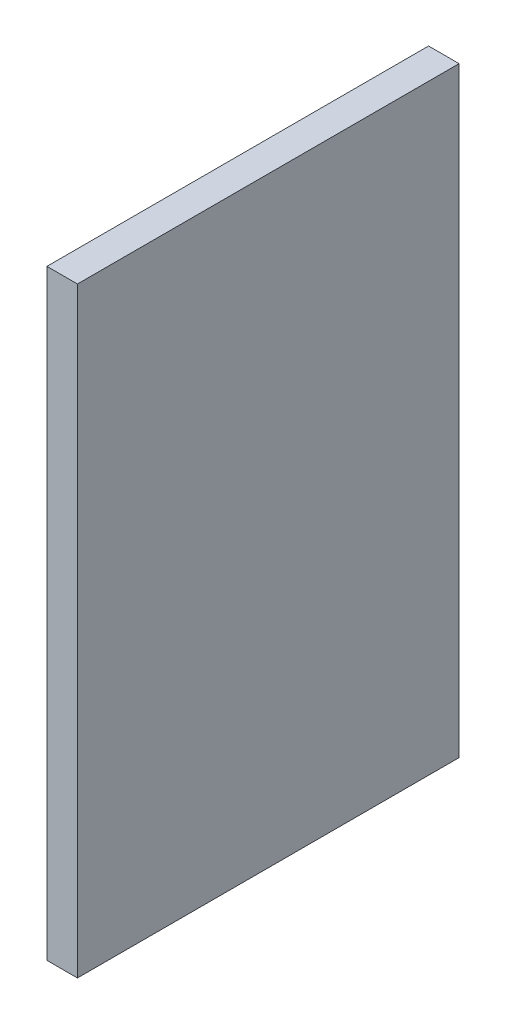
ISO-10303-21;
HEADER;
FILE_DESCRIPTION(('STEP AP214'),'2;1');
FILE_NAME('part.step','',(''),(''),'','','');
FILE_SCHEMA(('AUTOMOTIVE_DESIGN { 1 0 10303 214 1 1 1 1 }'));
ENDSEC;
DATA;
#1=APPLICATION_CONTEXT('core data for automotive mechanical design processes');
#2=APPLICATION_PROTOCOL_DEFINITION('international standard','automotive_design',2000,#1);
#3=PRODUCT_CONTEXT('',#1,'mechanical');
#4=PRODUCT('Part','Part','',(#3));
#5=PRODUCT_RELATED_PRODUCT_CATEGORY('part','',(#4));
#6=PRODUCT_DEFINITION_FORMATION('','',#4);
#7=PRODUCT_DEFINITION_CONTEXT('part definition',#1,'design');
#8=PRODUCT_DEFINITION('design','',#6,#7);
#9=PRODUCT_DEFINITION_SHAPE('','',#8);
#10=(LENGTH_UNIT() NAMED_UNIT(*) SI_UNIT(.MILLI.,.METRE.));
#11=(NAMED_UNIT(*) PLANE_ANGLE_UNIT() SI_UNIT($,.RADIAN.));
#12=(NAMED_UNIT(*) SI_UNIT($,.STERADIAN.) SOLID_ANGLE_UNIT());
#13=UNCERTAINTY_MEASURE_WITH_UNIT(LENGTH_MEASURE(1.E-05),#10,'distance_accuracy_value','');
#14=(GEOMETRIC_REPRESENTATION_CONTEXT(3) GLOBAL_UNCERTAINTY_ASSIGNED_CONTEXT((#13)) GLOBAL_UNIT_ASSIGNED_CONTEXT((#10,
#11,#12)) REPRESENTATION_CONTEXT('',''));
#15=CARTESIAN_POINT('',(0.,0.,0.));
#16=DIRECTION('',(0.,0.,1.));
#17=DIRECTION('',(1.,0.,0.));
#18=AXIS2_PLACEMENT_3D('',#15,#16,#17);
#19=CARTESIAN_POINT('',(0.,49.9999,0.));
#20=DIRECTION('',(1.,0.,0.));
#21=DIRECTION('',(0.,0.,-1.));
#22=AXIS2_PLACEMENT_3D('',#19,#20,#21);
#23=PLANE('',#22);
#24=CARTESIAN_POINT('',(0.,35.0012,-15.8750000000001));
#25=DIRECTION('',(1.,0.,0.));
#26=DIRECTION('',(0.,0.,1.));
#27=AXIS2_PLACEMENT_3D('',#24,#25,#26);
#28=CIRCLE('',#27,2.99974);
#29=CARTESIAN_POINT('',(0.,35.0012,-12.8752600000001));
#30=VERTEX_POINT('',#29);
#31=EDGE_CURVE('E291',#30,#30,#28,.T.);
#32=ORIENTED_EDGE('',*,*,#31,.T.);
#33=EDGE_LOOP('',(#32));
#34=FACE_BOUND('',#33,.T.);
#35=CARTESIAN_POINT('',(0.,15.00124,-15.875));
#36=DIRECTION('',(1.,0.,0.));
#37=DIRECTION('',(0.,0.,-1.));
#38=AXIS2_PLACEMENT_3D('',#35,#36,#37);
#39=CIRCLE('',#38,2.99974);
#40=CARTESIAN_POINT('',(0.,15.00124,-18.87474));
#41=VERTEX_POINT('',#40);
#42=EDGE_CURVE('E281',#41,#41,#39,.T.);
#43=ORIENTED_EDGE('',*,*,#42,.T.);
#44=EDGE_LOOP('',(#43));
#45=FACE_BOUND('',#44,.T.);
#46=DIRECTION('',(0.,0.,1.));
#47=VECTOR('',#46,1.);
#48=CARTESIAN_POINT('',(0.,0.,0.));
#49=LINE('',#48,#47);
#50=CARTESIAN_POINT('',(0.,0.,-31.75));
#51=VERTEX_POINT('',#50);
#52=CARTESIAN_POINT('',(0.,0.,0.));
#53=VERTEX_POINT('',#52);
#54=EDGE_CURVE('E122',#51,#53,#49,.T.);
#55=ORIENTED_EDGE('',*,*,#54,.T.);
#56=DIRECTION('',(0.,-1.,0.));
#57=VECTOR('',#56,1.);
#58=CARTESIAN_POINT('',(0.,49.9999,0.));
#59=LINE('',#58,#57);
#60=CARTESIAN_POINT('',(0.,49.9999,0.));
#61=VERTEX_POINT('',#60);
#62=EDGE_CURVE('E109',#61,#53,#59,.T.);
#63=ORIENTED_EDGE('',*,*,#62,.F.);
#64=DIRECTION('',(0.,0.,1.));
#65=VECTOR('',#64,1.);
#66=CARTESIAN_POINT('',(0.,49.9999,0.));
#67=LINE('',#66,#65);
#68=CARTESIAN_POINT('',(0.,49.9999,-31.75));
#69=VERTEX_POINT('',#68);
#70=EDGE_CURVE('E101',#69,#61,#67,.T.);
#71=ORIENTED_EDGE('',*,*,#70,.F.);
#72=DIRECTION('',(0.,-1.,0.));
#73=VECTOR('',#72,1.);
#74=CARTESIAN_POINT('',(0.,49.9999,-31.75));
#75=LINE('',#74,#73);
#76=EDGE_CURVE('E118',#69,#51,#75,.T.);
#77=ORIENTED_EDGE('',*,*,#76,.T.);
#78=EDGE_LOOP('',(#55,#63,#71,#77));
#79=FACE_BOUND('',#78,.T.);
#80=ADVANCED_FACE('F40',(#34,#45,#79),#23,.F.);
#81=CARTESIAN_POINT('',(0.,49.9999,0.));
#82=DIRECTION('',(0.,0.,-1.));
#83=DIRECTION('',(-1.,0.,0.));
#84=AXIS2_PLACEMENT_3D('',#81,#82,#83);
#85=PLANE('',#84);
#86=DIRECTION('',(1.,0.,0.));
#87=VECTOR('',#86,1.);
#88=CARTESIAN_POINT('',(0.,0.,0.));
#89=LINE('',#88,#87);
#90=CARTESIAN_POINT('',(2.54,0.,0.));
#91=VERTEX_POINT('',#90);
#92=EDGE_CURVE('E107',#53,#91,#89,.T.);
#93=ORIENTED_EDGE('',*,*,#92,.T.);
#94=DIRECTION('',(0.,-1.,0.));
#95=VECTOR('',#94,1.);
#96=CARTESIAN_POINT('',(2.54,49.9999,0.));
#97=LINE('',#96,#95);
#98=CARTESIAN_POINT('',(2.54,49.9999,0.));
#99=VERTEX_POINT('',#98);
#100=EDGE_CURVE('E105',#99,#91,#97,.T.);
#101=ORIENTED_EDGE('',*,*,#100,.F.);
#102=DIRECTION('',(1.,0.,0.));
#103=VECTOR('',#102,1.);
#104=CARTESIAN_POINT('',(0.,49.9999,0.));
#105=LINE('',#104,#103);
#106=EDGE_CURVE('E96',#61,#99,#105,.T.);
#107=ORIENTED_EDGE('',*,*,#106,.F.);
#108=ORIENTED_EDGE('',*,*,#62,.T.);
#109=EDGE_LOOP('',(#93,#101,#107,#108));
#110=FACE_BOUND('',#109,.T.);
#111=ADVANCED_FACE('F106',(#110),#85,.F.);
#112=CARTESIAN_POINT('',(2.54,49.9999,0.));
#113=DIRECTION('',(-1.,0.,0.));
#114=DIRECTION('',(0.,0.,1.));
#115=AXIS2_PLACEMENT_3D('',#112,#113,#114);
#116=PLANE('',#115);
#117=DIRECTION('',(0.,0.,-1.));
#118=VECTOR('',#117,1.);
#119=CARTESIAN_POINT('',(2.54,0.,0.));
#120=LINE('',#119,#118);
#121=CARTESIAN_POINT('',(2.54,0.,-31.75));
#122=VERTEX_POINT('',#121);
#123=EDGE_CURVE('E80',#91,#122,#120,.T.);
#124=ORIENTED_EDGE('',*,*,#123,.T.);
#125=DIRECTION('',(0.,-1.,0.));
#126=VECTOR('',#125,1.);
#127=CARTESIAN_POINT('',(2.54,49.9999,-31.75));
#128=LINE('',#127,#126);
#129=CARTESIAN_POINT('',(2.54,49.9999,-31.75));
#130=VERTEX_POINT('',#129);
#131=EDGE_CURVE('E110',#130,#122,#128,.T.);
#132=ORIENTED_EDGE('',*,*,#131,.F.);
#133=DIRECTION('',(0.,0.,-1.));
#134=VECTOR('',#133,1.);
#135=CARTESIAN_POINT('',(2.54,49.9999,0.));
#136=LINE('',#135,#134);
#137=EDGE_CURVE('E99',#99,#130,#136,.T.);
#138=ORIENTED_EDGE('',*,*,#137,.F.);
#139=ORIENTED_EDGE('',*,*,#100,.T.);
#140=EDGE_LOOP('',(#124,#132,#138,#139));
#141=FACE_BOUND('',#140,.T.);
#142=ADVANCED_FACE('F112',(#141),#116,.F.);
#143=CARTESIAN_POINT('',(0.,49.9999,-31.75));
#144=DIRECTION('',(0.,0.,1.));
#145=DIRECTION('',(1.,0.,0.));
#146=AXIS2_PLACEMENT_3D('',#143,#144,#145);
#147=PLANE('',#146);
#148=DIRECTION('',(-1.,0.,0.));
#149=VECTOR('',#148,1.);
#150=CARTESIAN_POINT('',(0.,0.,-31.75));
#151=LINE('',#150,#149);
#152=EDGE_CURVE('E86',#122,#51,#151,.T.);
#153=ORIENTED_EDGE('',*,*,#152,.T.);
#154=ORIENTED_EDGE('',*,*,#76,.F.);
#155=DIRECTION('',(-1.,0.,0.));
#156=VECTOR('',#155,1.);
#157=CARTESIAN_POINT('',(0.,49.9999,-31.75));
#158=LINE('',#157,#156);
#159=EDGE_CURVE('E60',#130,#69,#158,.T.);
#160=ORIENTED_EDGE('',*,*,#159,.F.);
#161=ORIENTED_EDGE('',*,*,#131,.T.);
#162=EDGE_LOOP('',(#153,#154,#160,#161));
#163=FACE_BOUND('',#162,.T.);
#164=ADVANCED_FACE('F188',(#163),#147,.F.);
#165=CARTESIAN_POINT('',(0.,49.9999,0.));
#166=DIRECTION('',(0.,-1.,0.));
#167=DIRECTION('',(0.,0.,-1.));
#168=AXIS2_PLACEMENT_3D('',#165,#166,#167);
#169=PLANE('',#168);
#170=ORIENTED_EDGE('',*,*,#70,.T.);
#171=ORIENTED_EDGE('',*,*,#106,.T.);
#172=ORIENTED_EDGE('',*,*,#137,.T.);
#173=ORIENTED_EDGE('',*,*,#159,.T.);
#174=EDGE_LOOP('',(#170,#171,#172,#173));
#175=FACE_BOUND('',#174,.T.);
#176=ADVANCED_FACE('F97',(#175),#169,.F.);
#177=CARTESIAN_POINT('',(0.,0.,0.));
#178=DIRECTION('',(0.,-1.,0.));
#179=DIRECTION('',(0.,0.,-1.));
#180=AXIS2_PLACEMENT_3D('',#177,#178,#179);
#181=PLANE('',#180);
#182=ORIENTED_EDGE('',*,*,#54,.F.);
#183=ORIENTED_EDGE('',*,*,#152,.F.);
#184=ORIENTED_EDGE('',*,*,#123,.F.);
#185=ORIENTED_EDGE('',*,*,#92,.F.);
#186=EDGE_LOOP('',(#182,#183,#184,#185));
#187=FACE_BOUND('',#186,.T.);
#188=ADVANCED_FACE('F184',(#187),#181,.T.);
#189=CARTESIAN_POINT('',(-8.6106,15.00124,-15.875));
#190=DIRECTION('',(1.,0.,0.));
#191=DIRECTION('',(0.,0.,-1.));
#192=AXIS2_PLACEMENT_3D('',#189,#190,#191);
#193=CYLINDRICAL_SURFACE('',#192,2.99974);
#194=CARTESIAN_POINT('',(-8.6106,15.00124,-15.875));
#195=DIRECTION('',(1.,0.,0.));
#196=DIRECTION('',(0.,0.,-1.));
#197=AXIS2_PLACEMENT_3D('',#194,#195,#196);
#198=CIRCLE('',#197,2.99974);
#199=CARTESIAN_POINT('',(-8.6106,15.00124,-18.87474));
#200=VERTEX_POINT('',#199);
#201=EDGE_CURVE('E126',#200,#200,#198,.T.);
#202=ORIENTED_EDGE('',*,*,#201,.T.);
#203=EDGE_LOOP('',(#202));
#204=FACE_BOUND('',#203,.T.);
#205=ORIENTED_EDGE('',*,*,#42,.F.);
#206=EDGE_LOOP('',(#205));
#207=FACE_BOUND('',#206,.T.);
#208=ADVANCED_FACE('F180',(#204,#207),#193,.T.);
#209=CARTESIAN_POINT('',(-8.6106,15.00124,-15.875));
#210=DIRECTION('',(1.,0.,0.));
#211=DIRECTION('',(0.,0.,-1.));
#212=AXIS2_PLACEMENT_3D('',#209,#210,#211);
#213=PLANE('',#212);
#214=CARTESIAN_POINT('',(-8.6106,15.00124,-15.875));
#215=DIRECTION('',(1.,0.,0.));
#216=DIRECTION('',(0.,0.,-1.));
#217=AXIS2_PLACEMENT_3D('',#214,#215,#216);
#218=CIRCLE('',#217,1.6002);
#219=CARTESIAN_POINT('',(-8.6106,15.00124,-17.4752));
#220=VERTEX_POINT('',#219);
#221=EDGE_CURVE('E284',#220,#220,#218,.T.);
#222=ORIENTED_EDGE('',*,*,#221,.T.);
#223=EDGE_LOOP('',(#222));
#224=FACE_BOUND('',#223,.T.);
#225=ORIENTED_EDGE('',*,*,#201,.F.);
#226=EDGE_LOOP('',(#225));
#227=FACE_BOUND('',#226,.T.);
#228=ADVANCED_FACE('F156',(#224,#227),#213,.F.);
#229=CARTESIAN_POINT('',(-8.6106,15.00124,-15.875));
#230=DIRECTION('',(1.,0.,0.));
#231=DIRECTION('',(0.,0.,-1.));
#232=AXIS2_PLACEMENT_3D('',#229,#230,#231);
#233=CYLINDRICAL_SURFACE('',#232,1.6002);
#234=ORIENTED_EDGE('',*,*,#221,.F.);
#235=EDGE_LOOP('',(#234));
#236=FACE_BOUND('',#235,.T.);
#237=CARTESIAN_POINT('',(0.,15.00124,-15.875));
#238=DIRECTION('',(1.,0.,0.));
#239=DIRECTION('',(0.,0.,-1.));
#240=AXIS2_PLACEMENT_3D('',#237,#238,#239);
#241=CIRCLE('',#240,1.6002);
#242=CARTESIAN_POINT('',(0.,15.00124,-17.4752));
#243=VERTEX_POINT('',#242);
#244=EDGE_CURVE('E49',#243,#243,#241,.T.);
#245=ORIENTED_EDGE('',*,*,#244,.T.);
#246=EDGE_LOOP('',(#245));
#247=FACE_BOUND('',#246,.T.);
#248=ADVANCED_FACE('F143',(#236,#247),#233,.F.);
#249=ORIENTED_EDGE('',*,*,#244,.F.);
#250=EDGE_LOOP('',(#249));
#251=FACE_BOUND('',#250,.T.);
#252=ADVANCED_FACE('F145',(#251),#23,.F.);
#253=CARTESIAN_POINT('',(-8.6106,35.0012,-15.8750000000001));
#254=DIRECTION('',(1.,0.,0.));
#255=DIRECTION('',(0.,0.,-1.));
#256=AXIS2_PLACEMENT_3D('',#253,#254,#255);
#257=CYLINDRICAL_SURFACE('',#256,2.99974);
#258=CARTESIAN_POINT('',(-8.6106,35.0012,-15.8750000000001));
#259=DIRECTION('',(1.,0.,0.));
#260=DIRECTION('',(0.,0.,1.));
#261=AXIS2_PLACEMENT_3D('',#258,#259,#260);
#262=CIRCLE('',#261,2.99974);
#263=CARTESIAN_POINT('',(-8.6106,35.0012,-12.8752600000001));
#264=VERTEX_POINT('',#263);
#265=EDGE_CURVE('E290',#264,#264,#262,.T.);
#266=ORIENTED_EDGE('',*,*,#265,.T.);
#267=EDGE_LOOP('',(#266));
#268=FACE_BOUND('',#267,.T.);
#269=ORIENTED_EDGE('',*,*,#31,.F.);
#270=EDGE_LOOP('',(#269));
#271=FACE_BOUND('',#270,.T.);
#272=ADVANCED_FACE('F147',(#268,#271),#257,.T.);
#273=CARTESIAN_POINT('',(-8.6106,35.0012,-15.8750000000001));
#274=DIRECTION('',(-1.,0.,0.));
#275=DIRECTION('',(0.,0.,1.));
#276=AXIS2_PLACEMENT_3D('',#273,#274,#275);
#277=PLANE('',#276);
#278=CARTESIAN_POINT('',(-8.6106,35.0012,-15.8750000000001));
#279=DIRECTION('',(1.,0.,0.));
#280=DIRECTION('',(0.,0.,1.));
#281=AXIS2_PLACEMENT_3D('',#278,#279,#280);
#282=CIRCLE('',#281,1.6002);
#283=CARTESIAN_POINT('',(-8.6106,35.0012,-14.2748000000001));
#284=VERTEX_POINT('',#283);
#285=EDGE_CURVE('E295',#284,#284,#282,.T.);
#286=ORIENTED_EDGE('',*,*,#285,.T.);
#287=EDGE_LOOP('',(#286));
#288=FACE_BOUND('',#287,.T.);
#289=ORIENTED_EDGE('',*,*,#265,.F.);
#290=EDGE_LOOP('',(#289));
#291=FACE_BOUND('',#290,.T.);
#292=ADVANCED_FACE('F153',(#288,#291),#277,.T.);
#293=CARTESIAN_POINT('',(-8.6106,35.0012,-15.8750000000001));
#294=DIRECTION('',(1.,0.,0.));
#295=DIRECTION('',(0.,0.,-1.));
#296=AXIS2_PLACEMENT_3D('',#293,#294,#295);
#297=CYLINDRICAL_SURFACE('',#296,1.6002);
#298=ORIENTED_EDGE('',*,*,#285,.F.);
#299=EDGE_LOOP('',(#298));
#300=FACE_BOUND('',#299,.T.);
#301=CARTESIAN_POINT('',(0.,35.0012,-15.8750000000001));
#302=DIRECTION('',(1.,0.,0.));
#303=DIRECTION('',(0.,0.,-1.));
#304=AXIS2_PLACEMENT_3D('',#301,#302,#303);
#305=CIRCLE('',#304,1.6002);
#306=CARTESIAN_POINT('',(0.,35.0012,-17.4752000000001));
#307=VERTEX_POINT('',#306);
#308=EDGE_CURVE('E11',#307,#307,#305,.T.);
#309=ORIENTED_EDGE('',*,*,#308,.T.);
#310=EDGE_LOOP('',(#309));
#311=FACE_BOUND('',#310,.T.);
#312=ADVANCED_FACE('F162',(#300,#311),#297,.F.);
#313=ORIENTED_EDGE('',*,*,#308,.F.);
#314=EDGE_LOOP('',(#313));
#315=FACE_BOUND('',#314,.T.);
#316=ADVANCED_FACE('F148',(#315),#23,.F.);
#317=CLOSED_SHELL('',(#80,#111,#142,#164,#176,#188,#208,#228,#248,#252,#272,#292,#312,#316));
#318=MANIFOLD_SOLID_BREP('B2',#317);
#319=ADVANCED_BREP_SHAPE_REPRESENTATION('',(#18,#318),#14);
#320=SHAPE_DEFINITION_REPRESENTATION(#9,#319);
ENDSEC;
END-ISO-10303-21;
